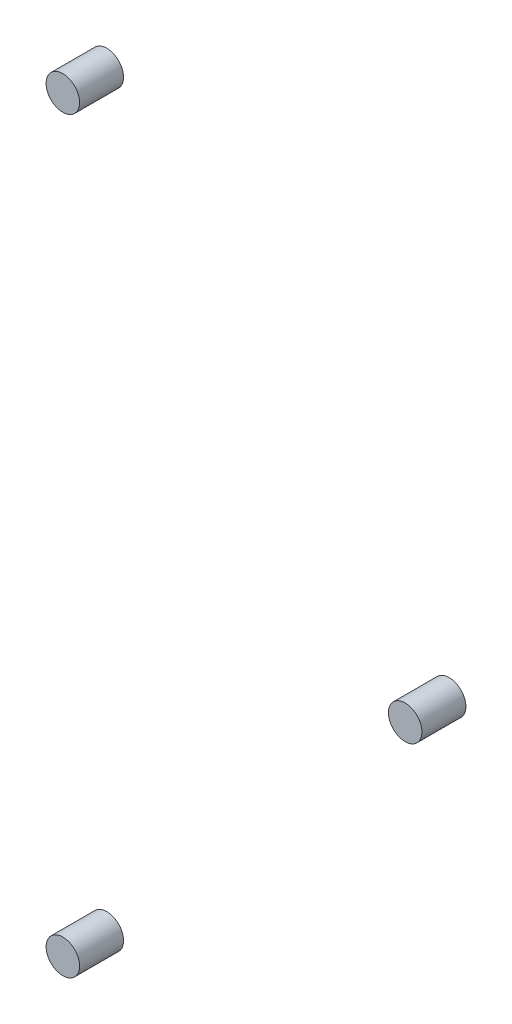
ISO-10303-21;
HEADER;
FILE_DESCRIPTION(('STEP AP214'),'2;1');
FILE_NAME('part.step','',(''),(''),'','','');
FILE_SCHEMA(('AUTOMOTIVE_DESIGN { 1 0 10303 214 1 1 1 1 }'));
ENDSEC;
DATA;
#1=APPLICATION_CONTEXT('core data for automotive mechanical design processes');
#2=APPLICATION_PROTOCOL_DEFINITION('international standard','automotive_design',2000,#1);
#3=PRODUCT_CONTEXT('',#1,'mechanical');
#4=PRODUCT('Part','Part','',(#3));
#5=PRODUCT_RELATED_PRODUCT_CATEGORY('part','',(#4));
#6=PRODUCT_DEFINITION_FORMATION('','',#4);
#7=PRODUCT_DEFINITION_CONTEXT('part definition',#1,'design');
#8=PRODUCT_DEFINITION('design','',#6,#7);
#9=PRODUCT_DEFINITION_SHAPE('','',#8);
#10=(LENGTH_UNIT() NAMED_UNIT(*) SI_UNIT(.MILLI.,.METRE.));
#11=(NAMED_UNIT(*) PLANE_ANGLE_UNIT() SI_UNIT($,.RADIAN.));
#12=(NAMED_UNIT(*) SI_UNIT($,.STERADIAN.) SOLID_ANGLE_UNIT());
#13=UNCERTAINTY_MEASURE_WITH_UNIT(LENGTH_MEASURE(1.E-05),#10,'distance_accuracy_value','');
#14=(GEOMETRIC_REPRESENTATION_CONTEXT(3) GLOBAL_UNCERTAINTY_ASSIGNED_CONTEXT((#13)) GLOBAL_UNIT_ASSIGNED_CONTEXT((#10,
#11,#12)) REPRESENTATION_CONTEXT('',''));
#15=CARTESIAN_POINT('',(0.,0.,0.));
#16=DIRECTION('',(0.,0.,1.));
#17=DIRECTION('',(1.,0.,0.));
#18=AXIS2_PLACEMENT_3D('',#15,#16,#17);
#19=CARTESIAN_POINT('',(37.8498978837851,-34.0207825137528,4.));
#20=DIRECTION('',(0.,0.,-1.));
#21=DIRECTION('',(-1.,0.,0.));
#22=AXIS2_PLACEMENT_3D('',#19,#20,#21);
#23=CYLINDRICAL_SURFACE('',#22,1.525);
#24=CARTESIAN_POINT('',(37.8498978837851,-34.0207825137528,4.));
#25=DIRECTION('',(0.,0.,1.));
#26=DIRECTION('',(1.,0.,0.));
#27=AXIS2_PLACEMENT_3D('',#24,#25,#26);
#28=CIRCLE('',#27,1.525);
#29=CARTESIAN_POINT('',(39.3748978837851,-34.0207825137528,4.));
#30=VERTEX_POINT('',#29);
#31=EDGE_CURVE('E11',#30,#30,#28,.T.);
#32=ORIENTED_EDGE('',*,*,#31,.F.);
#33=EDGE_LOOP('',(#32));
#34=FACE_BOUND('',#33,.T.);
#35=CARTESIAN_POINT('',(37.8498978837851,-34.0207825137528,0.));
#36=DIRECTION('',(0.,0.,1.));
#37=DIRECTION('',(1.,0.,0.));
#38=AXIS2_PLACEMENT_3D('',#35,#36,#37);
#39=CIRCLE('',#38,1.525);
#40=CARTESIAN_POINT('',(39.3748978837851,-34.0207825137528,0.));
#41=VERTEX_POINT('',#40);
#42=EDGE_CURVE('E45',#41,#41,#39,.T.);
#43=ORIENTED_EDGE('',*,*,#42,.T.);
#44=EDGE_LOOP('',(#43));
#45=FACE_BOUND('',#44,.T.);
#46=ADVANCED_FACE('F42',(#34,#45),#23,.T.);
#47=CARTESIAN_POINT('',(37.8498978837851,-34.0207825137528,4.));
#48=DIRECTION('',(0.,0.,1.));
#49=DIRECTION('',(1.,0.,0.));
#50=AXIS2_PLACEMENT_3D('',#47,#48,#49);
#51=PLANE('',#50);
#52=ORIENTED_EDGE('',*,*,#31,.T.);
#53=EDGE_LOOP('',(#52));
#54=FACE_BOUND('',#53,.T.);
#55=ADVANCED_FACE('F57',(#54),#51,.T.);
#56=CARTESIAN_POINT('',(37.8498978837851,-34.0207825137528,0.));
#57=DIRECTION('',(0.,0.,1.));
#58=DIRECTION('',(1.,0.,0.));
#59=AXIS2_PLACEMENT_3D('',#56,#57,#58);
#60=PLANE('',#59);
#61=ORIENTED_EDGE('',*,*,#42,.F.);
#62=EDGE_LOOP('',(#61));
#63=FACE_BOUND('',#62,.T.);
#64=ADVANCED_FACE('F55',(#63),#60,.F.);
#65=CLOSED_SHELL('',(#46,#55,#64));
#66=MANIFOLD_SOLID_BREP('B2',#65);
#67=CARTESIAN_POINT('',(69.,0.,4.));
#68=DIRECTION('',(0.,0.,-1.));
#69=DIRECTION('',(-1.,0.,0.));
#70=AXIS2_PLACEMENT_3D('',#67,#68,#69);
#71=CYLINDRICAL_SURFACE('',#70,1.525);
#72=CARTESIAN_POINT('',(69.,0.,4.));
#73=DIRECTION('',(0.,0.,1.));
#74=DIRECTION('',(1.,0.,0.));
#75=AXIS2_PLACEMENT_3D('',#72,#73,#74);
#76=CIRCLE('',#75,1.525);
#77=CARTESIAN_POINT('',(70.525,0.,4.));
#78=VERTEX_POINT('',#77);
#79=EDGE_CURVE('E41',#78,#78,#76,.T.);
#80=ORIENTED_EDGE('',*,*,#79,.F.);
#81=EDGE_LOOP('',(#80));
#82=FACE_BOUND('',#81,.T.);
#83=CARTESIAN_POINT('',(69.,0.,0.));
#84=DIRECTION('',(0.,0.,1.));
#85=DIRECTION('',(1.,0.,0.));
#86=AXIS2_PLACEMENT_3D('',#83,#84,#85);
#87=CIRCLE('',#86,1.525);
#88=CARTESIAN_POINT('',(70.525,0.,0.));
#89=VERTEX_POINT('',#88);
#90=EDGE_CURVE('E93',#89,#89,#87,.T.);
#91=ORIENTED_EDGE('',*,*,#90,.T.);
#92=EDGE_LOOP('',(#91));
#93=FACE_BOUND('',#92,.T.);
#94=ADVANCED_FACE('F90',(#82,#93),#71,.T.);
#95=CARTESIAN_POINT('',(69.,0.,4.));
#96=DIRECTION('',(0.,0.,1.));
#97=DIRECTION('',(1.,0.,0.));
#98=AXIS2_PLACEMENT_3D('',#95,#96,#97);
#99=PLANE('',#98);
#100=ORIENTED_EDGE('',*,*,#79,.T.);
#101=EDGE_LOOP('',(#100));
#102=FACE_BOUND('',#101,.T.);
#103=ADVANCED_FACE('F105',(#102),#99,.T.);
#104=CARTESIAN_POINT('',(69.,0.,0.));
#105=DIRECTION('',(0.,0.,1.));
#106=DIRECTION('',(1.,0.,0.));
#107=AXIS2_PLACEMENT_3D('',#104,#105,#106);
#108=PLANE('',#107);
#109=ORIENTED_EDGE('',*,*,#90,.F.);
#110=EDGE_LOOP('',(#109));
#111=FACE_BOUND('',#110,.T.);
#112=ADVANCED_FACE('F103',(#111),#108,.F.);
#113=CLOSED_SHELL('',(#94,#103,#112));
#114=MANIFOLD_SOLID_BREP('B6',#113);
#115=CARTESIAN_POINT('',(37.8498978837851,34.0207825137528,4.));
#116=DIRECTION('',(0.,0.,-1.));
#117=DIRECTION('',(-1.,0.,0.));
#118=AXIS2_PLACEMENT_3D('',#115,#116,#117);
#119=CYLINDRICAL_SURFACE('',#118,1.525);
#120=CARTESIAN_POINT('',(37.8498978837851,34.0207825137528,4.));
#121=DIRECTION('',(0.,0.,1.));
#122=DIRECTION('',(1.,0.,0.));
#123=AXIS2_PLACEMENT_3D('',#120,#121,#122);
#124=CIRCLE('',#123,1.525);
#125=CARTESIAN_POINT('',(39.3748978837851,34.0207825137528,4.));
#126=VERTEX_POINT('',#125);
#127=EDGE_CURVE('E89',#126,#126,#124,.T.);
#128=ORIENTED_EDGE('',*,*,#127,.F.);
#129=EDGE_LOOP('',(#128));
#130=FACE_BOUND('',#129,.T.);
#131=CARTESIAN_POINT('',(37.8498978837851,34.0207825137528,0.));
#132=DIRECTION('',(0.,0.,1.));
#133=DIRECTION('',(1.,0.,0.));
#134=AXIS2_PLACEMENT_3D('',#131,#132,#133);
#135=CIRCLE('',#134,1.525);
#136=CARTESIAN_POINT('',(39.3748978837851,34.0207825137528,0.));
#137=VERTEX_POINT('',#136);
#138=EDGE_CURVE('E134',#137,#137,#135,.T.);
#139=ORIENTED_EDGE('',*,*,#138,.T.);
#140=EDGE_LOOP('',(#139));
#141=FACE_BOUND('',#140,.T.);
#142=ADVANCED_FACE('F131',(#130,#141),#119,.T.);
#143=CARTESIAN_POINT('',(37.8498978837851,34.0207825137528,4.));
#144=DIRECTION('',(0.,0.,1.));
#145=DIRECTION('',(1.,0.,0.));
#146=AXIS2_PLACEMENT_3D('',#143,#144,#145);
#147=PLANE('',#146);
#148=ORIENTED_EDGE('',*,*,#127,.T.);
#149=EDGE_LOOP('',(#148));
#150=FACE_BOUND('',#149,.T.);
#151=ADVANCED_FACE('F146',(#150),#147,.T.);
#152=CARTESIAN_POINT('',(37.8498978837851,34.0207825137528,0.));
#153=DIRECTION('',(0.,0.,1.));
#154=DIRECTION('',(1.,0.,0.));
#155=AXIS2_PLACEMENT_3D('',#152,#153,#154);
#156=PLANE('',#155);
#157=ORIENTED_EDGE('',*,*,#138,.F.);
#158=EDGE_LOOP('',(#157));
#159=FACE_BOUND('',#158,.T.);
#160=ADVANCED_FACE('F144',(#159),#156,.F.);
#161=CLOSED_SHELL('',(#142,#151,#160));
#162=MANIFOLD_SOLID_BREP('B36',#161);
#163=ADVANCED_BREP_SHAPE_REPRESENTATION('',(#18,#66,#114,#162),#14);
#164=SHAPE_DEFINITION_REPRESENTATION(#9,#163);
ENDSEC;
END-ISO-10303-21;
